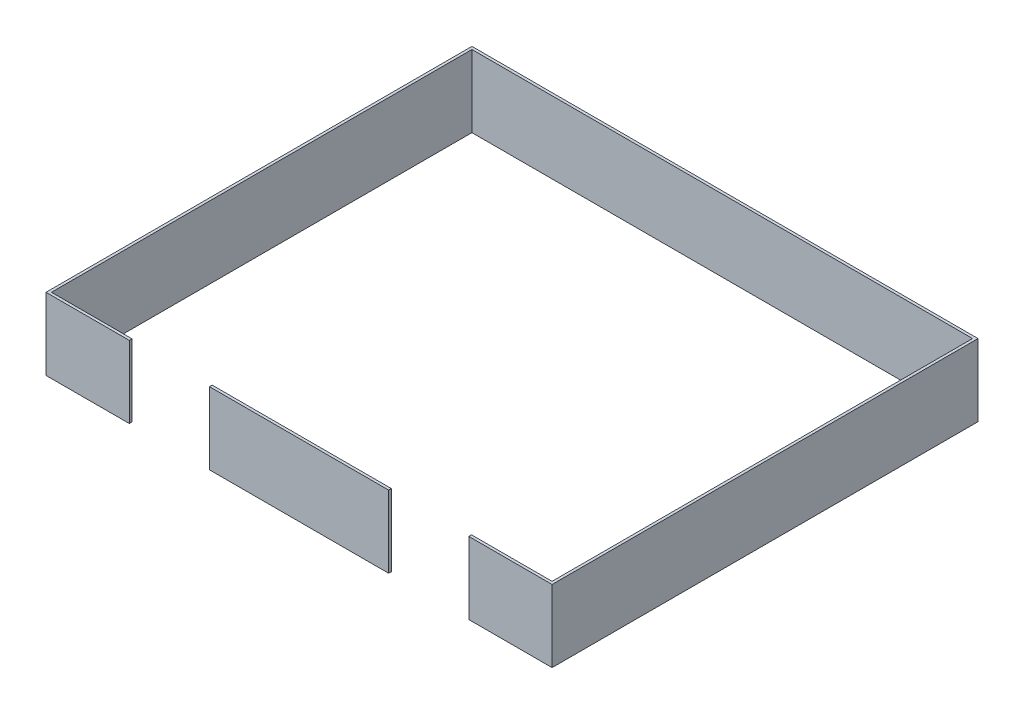
ISO-10303-21;
HEADER;
FILE_DESCRIPTION(('STEP AP214'),'2;1');
FILE_NAME('part.step','',(''),(''),'','','');
FILE_SCHEMA(('AUTOMOTIVE_DESIGN { 1 0 10303 214 1 1 1 1 }'));
ENDSEC;
DATA;
#1=APPLICATION_CONTEXT('core data for automotive mechanical design processes');
#2=APPLICATION_PROTOCOL_DEFINITION('international standard','automotive_design',2000,#1);
#3=PRODUCT_CONTEXT('',#1,'mechanical');
#4=PRODUCT('Part','Part','',(#3));
#5=PRODUCT_RELATED_PRODUCT_CATEGORY('part','',(#4));
#6=PRODUCT_DEFINITION_FORMATION('','',#4);
#7=PRODUCT_DEFINITION_CONTEXT('part definition',#1,'design');
#8=PRODUCT_DEFINITION('design','',#6,#7);
#9=PRODUCT_DEFINITION_SHAPE('','',#8);
#10=(LENGTH_UNIT() NAMED_UNIT(*) SI_UNIT(.MILLI.,.METRE.));
#11=(NAMED_UNIT(*) PLANE_ANGLE_UNIT() SI_UNIT($,.RADIAN.));
#12=(NAMED_UNIT(*) SI_UNIT($,.STERADIAN.) SOLID_ANGLE_UNIT());
#13=UNCERTAINTY_MEASURE_WITH_UNIT(LENGTH_MEASURE(1.E-05),#10,'distance_accuracy_value','');
#14=(GEOMETRIC_REPRESENTATION_CONTEXT(3) GLOBAL_UNCERTAINTY_ASSIGNED_CONTEXT((#13)) GLOBAL_UNIT_ASSIGNED_CONTEXT((#10,
#11,#12)) REPRESENTATION_CONTEXT('',''));
#15=CARTESIAN_POINT('',(0.,0.,0.));
#16=DIRECTION('',(0.,0.,1.));
#17=DIRECTION('',(1.,0.,0.));
#18=AXIS2_PLACEMENT_3D('',#15,#16,#17);
#19=CARTESIAN_POINT('',(3568.7,1016.,3003.54999999999));
#20=DIRECTION('',(0.,0.,1.));
#21=DIRECTION('',(1.,0.,0.));
#22=AXIS2_PLACEMENT_3D('',#19,#20,#21);
#23=PLANE('',#22);
#24=DIRECTION('',(0.,1.,0.));
#25=VECTOR('',#24,1.);
#26=CARTESIAN_POINT('',(2393.95,-1032.764,3003.54999999999));
#27=LINE('',#26,#25);
#28=CARTESIAN_POINT('',(2393.95,0.,3003.54999999999));
#29=VERTEX_POINT('',#28);
#30=CARTESIAN_POINT('',(2393.95,1016.,3003.54999999999));
#31=VERTEX_POINT('',#30);
#32=EDGE_CURVE('E212',#29,#31,#27,.T.);
#33=ORIENTED_EDGE('',*,*,#32,.F.);
#34=DIRECTION('',(-1.,0.,0.));
#35=VECTOR('',#34,1.);
#36=CARTESIAN_POINT('',(3568.7,0.,3003.54999999999));
#37=LINE('',#36,#35);
#38=CARTESIAN_POINT('',(3568.7,0.,3003.54999999999));
#39=VERTEX_POINT('',#38);
#40=EDGE_CURVE('E217',#39,#29,#37,.T.);
#41=ORIENTED_EDGE('',*,*,#40,.F.);
#42=DIRECTION('',(0.,-1.,0.));
#43=VECTOR('',#42,1.);
#44=CARTESIAN_POINT('',(3568.7,1016.,3003.54999999999));
#45=LINE('',#44,#43);
#46=CARTESIAN_POINT('',(3568.7,1016.,3003.54999999999));
#47=VERTEX_POINT('',#46);
#48=EDGE_CURVE('E240',#47,#39,#45,.T.);
#49=ORIENTED_EDGE('',*,*,#48,.F.);
#50=DIRECTION('',(-1.,0.,0.));
#51=VECTOR('',#50,1.);
#52=CARTESIAN_POINT('',(3568.7,1016.,3003.54999999999));
#53=LINE('',#52,#51);
#54=EDGE_CURVE('E183',#47,#31,#53,.T.);
#55=ORIENTED_EDGE('',*,*,#54,.T.);
#56=EDGE_LOOP('',(#33,#41,#49,#55));
#57=FACE_BOUND('',#56,.T.);
#58=ADVANCED_FACE('F71',(#57),#23,.T.);
#59=CARTESIAN_POINT('',(-3530.6,1016.,2965.44999999999));
#60=DIRECTION('',(0.,0.,-1.));
#61=DIRECTION('',(-1.,0.,0.));
#62=AXIS2_PLACEMENT_3D('',#59,#60,#61);
#63=PLANE('',#62);
#64=DIRECTION('',(0.,-1.,0.));
#65=VECTOR('',#64,1.);
#66=CARTESIAN_POINT('',(2393.95,1016.,2965.44999999999));
#67=LINE('',#66,#65);
#68=CARTESIAN_POINT('',(2393.95,1016.,2965.44999999999));
#69=VERTEX_POINT('',#68);
#70=CARTESIAN_POINT('',(2393.95,0.,2965.44999999999));
#71=VERTEX_POINT('',#70);
#72=EDGE_CURVE('E159',#69,#71,#67,.T.);
#73=ORIENTED_EDGE('',*,*,#72,.F.);
#74=DIRECTION('',(1.,0.,0.));
#75=VECTOR('',#74,1.);
#76=CARTESIAN_POINT('',(-3530.6,1016.,2965.44999999999));
#77=LINE('',#76,#75);
#78=CARTESIAN_POINT('',(3530.6,1016.,2965.44999999999));
#79=VERTEX_POINT('',#78);
#80=EDGE_CURVE('E174',#69,#79,#77,.T.);
#81=ORIENTED_EDGE('',*,*,#80,.T.);
#82=DIRECTION('',(0.,-1.,0.));
#83=VECTOR('',#82,1.);
#84=CARTESIAN_POINT('',(3530.6,1016.,2965.44999999999));
#85=LINE('',#84,#83);
#86=CARTESIAN_POINT('',(3530.6,0.,2965.44999999999));
#87=VERTEX_POINT('',#86);
#88=EDGE_CURVE('E182',#79,#87,#85,.T.);
#89=ORIENTED_EDGE('',*,*,#88,.T.);
#90=DIRECTION('',(1.,0.,0.));
#91=VECTOR('',#90,1.);
#92=CARTESIAN_POINT('',(-3530.6,0.,2965.44999999999));
#93=LINE('',#92,#91);
#94=EDGE_CURVE('E206',#71,#87,#93,.T.);
#95=ORIENTED_EDGE('',*,*,#94,.F.);
#96=EDGE_LOOP('',(#73,#81,#89,#95));
#97=FACE_BOUND('',#96,.T.);
#98=ADVANCED_FACE('F260',(#97),#63,.T.);
#99=CARTESIAN_POINT('',(0.,1016.,0.));
#100=DIRECTION('',(0.,1.,0.));
#101=DIRECTION('',(0.,0.,1.));
#102=AXIS2_PLACEMENT_3D('',#99,#100,#101);
#103=PLANE('',#102);
#104=DIRECTION('',(0.,0.,1.));
#105=VECTOR('',#104,1.);
#106=CARTESIAN_POINT('',(-2393.95,1016.,2965.44999999999));
#107=LINE('',#106,#105);
#108=CARTESIAN_POINT('',(-2393.95,1016.,2965.44999999999));
#109=VERTEX_POINT('',#108);
#110=CARTESIAN_POINT('',(-2393.95,1016.,3003.54999999999));
#111=VERTEX_POINT('',#110);
#112=EDGE_CURVE('E13',#109,#111,#107,.T.);
#113=ORIENTED_EDGE('',*,*,#112,.F.);
#114=CARTESIAN_POINT('',(-3530.6,1016.,2965.44999999999));
#115=VERTEX_POINT('',#114);
#116=EDGE_CURVE('E165',#115,#109,#77,.T.);
#117=ORIENTED_EDGE('',*,*,#116,.F.);
#118=DIRECTION('',(0.,0.,1.));
#119=VECTOR('',#118,1.);
#120=CARTESIAN_POINT('',(-3530.6,1016.,-2965.45));
#121=LINE('',#120,#119);
#122=CARTESIAN_POINT('',(-3530.6,1016.,-2965.45));
#123=VERTEX_POINT('',#122);
#124=EDGE_CURVE('E226',#123,#115,#121,.T.);
#125=ORIENTED_EDGE('',*,*,#124,.F.);
#126=DIRECTION('',(1.,0.,0.));
#127=VECTOR('',#126,1.);
#128=CARTESIAN_POINT('',(-3530.6,1016.,-2965.45));
#129=LINE('',#128,#127);
#130=CARTESIAN_POINT('',(3530.6,1016.,-2965.45));
#131=VERTEX_POINT('',#130);
#132=EDGE_CURVE('E189',#123,#131,#129,.T.);
#133=ORIENTED_EDGE('',*,*,#132,.T.);
#134=DIRECTION('',(0.,0.,1.));
#135=VECTOR('',#134,1.);
#136=CARTESIAN_POINT('',(3530.6,1016.,-2965.45));
#137=LINE('',#136,#135);
#138=EDGE_CURVE('E220',#131,#79,#137,.T.);
#139=ORIENTED_EDGE('',*,*,#138,.T.);
#140=ORIENTED_EDGE('',*,*,#80,.F.);
#141=DIRECTION('',(0.,0.,-1.));
#142=VECTOR('',#141,1.);
#143=CARTESIAN_POINT('',(2393.95,1016.,3003.54999999999));
#144=LINE('',#143,#142);
#145=EDGE_CURVE('E209',#31,#69,#144,.T.);
#146=ORIENTED_EDGE('',*,*,#145,.F.);
#147=ORIENTED_EDGE('',*,*,#54,.F.);
#148=DIRECTION('',(0.,0.,1.));
#149=VECTOR('',#148,1.);
#150=CARTESIAN_POINT('',(3568.7,1016.,-3003.55));
#151=LINE('',#150,#149);
#152=CARTESIAN_POINT('',(3568.7,1016.,-3003.55));
#153=VERTEX_POINT('',#152);
#154=EDGE_CURVE('E200',#153,#47,#151,.T.);
#155=ORIENTED_EDGE('',*,*,#154,.F.);
#156=DIRECTION('',(-1.,0.,0.));
#157=VECTOR('',#156,1.);
#158=CARTESIAN_POINT('',(3568.7,1016.,-3003.55));
#159=LINE('',#158,#157);
#160=CARTESIAN_POINT('',(-3568.7,1016.,-3003.55));
#161=VERTEX_POINT('',#160);
#162=EDGE_CURVE('E223',#153,#161,#159,.T.);
#163=ORIENTED_EDGE('',*,*,#162,.T.);
#164=DIRECTION('',(0.,0.,1.));
#165=VECTOR('',#164,1.);
#166=CARTESIAN_POINT('',(-3568.7,1016.,-3003.55));
#167=LINE('',#166,#165);
#168=CARTESIAN_POINT('',(-3568.7,1016.,3003.54999999999));
#169=VERTEX_POINT('',#168);
#170=EDGE_CURVE('E235',#161,#169,#167,.T.);
#171=ORIENTED_EDGE('',*,*,#170,.T.);
#172=EDGE_CURVE('E167',#111,#169,#53,.T.);
#173=ORIENTED_EDGE('',*,*,#172,.F.);
#174=EDGE_LOOP('',(#113,#117,#125,#133,#139,#140,#146,#147,#155,#163,#171,#173));
#175=FACE_BOUND('',#174,.T.);
#176=ADVANCED_FACE('F73',(#175),#103,.T.);
#177=CARTESIAN_POINT('',(0.,0.,0.));
#178=DIRECTION('',(0.,1.,0.));
#179=DIRECTION('',(0.,0.,1.));
#180=AXIS2_PLACEMENT_3D('',#177,#178,#179);
#181=PLANE('',#180);
#182=CARTESIAN_POINT('',(-3530.6,0.,2965.44999999999));
#183=VERTEX_POINT('',#182);
#184=CARTESIAN_POINT('',(-2393.95,0.,2965.44999999999));
#185=VERTEX_POINT('',#184);
#186=EDGE_CURVE('E75',#183,#185,#93,.T.);
#187=ORIENTED_EDGE('',*,*,#186,.T.);
#188=DIRECTION('',(0.,0.,1.));
#189=VECTOR('',#188,1.);
#190=CARTESIAN_POINT('',(-2393.95,0.,0.));
#191=LINE('',#190,#189);
#192=CARTESIAN_POINT('',(-2393.95,0.,3003.54999999999));
#193=VERTEX_POINT('',#192);
#194=EDGE_CURVE('E90',#185,#193,#191,.T.);
#195=ORIENTED_EDGE('',*,*,#194,.T.);
#196=CARTESIAN_POINT('',(-3568.7,0.,3003.54999999999));
#197=VERTEX_POINT('',#196);
#198=EDGE_CURVE('E219',#193,#197,#37,.T.);
#199=ORIENTED_EDGE('',*,*,#198,.T.);
#200=DIRECTION('',(0.,0.,1.));
#201=VECTOR('',#200,1.);
#202=CARTESIAN_POINT('',(-3568.7,0.,-3003.55));
#203=LINE('',#202,#201);
#204=CARTESIAN_POINT('',(-3568.7,0.,-3003.55));
#205=VERTEX_POINT('',#204);
#206=EDGE_CURVE('E179',#205,#197,#203,.T.);
#207=ORIENTED_EDGE('',*,*,#206,.F.);
#208=DIRECTION('',(-1.,0.,0.));
#209=VECTOR('',#208,1.);
#210=CARTESIAN_POINT('',(3568.7,0.,-3003.55));
#211=LINE('',#210,#209);
#212=CARTESIAN_POINT('',(3568.7,0.,-3003.55));
#213=VERTEX_POINT('',#212);
#214=EDGE_CURVE('E244',#213,#205,#211,.T.);
#215=ORIENTED_EDGE('',*,*,#214,.F.);
#216=DIRECTION('',(0.,0.,1.));
#217=VECTOR('',#216,1.);
#218=CARTESIAN_POINT('',(3568.7,0.,-3003.55));
#219=LINE('',#218,#217);
#220=EDGE_CURVE('E246',#213,#39,#219,.T.);
#221=ORIENTED_EDGE('',*,*,#220,.T.);
#222=ORIENTED_EDGE('',*,*,#40,.T.);
#223=DIRECTION('',(0.,0.,-1.));
#224=VECTOR('',#223,1.);
#225=CARTESIAN_POINT('',(2393.95000000003,0.,2.7903605352246E-11));
#226=LINE('',#225,#224);
#227=EDGE_CURVE('E214',#29,#71,#226,.T.);
#228=ORIENTED_EDGE('',*,*,#227,.T.);
#229=ORIENTED_EDGE('',*,*,#94,.T.);
#230=DIRECTION('',(0.,0.,1.));
#231=VECTOR('',#230,1.);
#232=CARTESIAN_POINT('',(3530.6,0.,-2965.45));
#233=LINE('',#232,#231);
#234=CARTESIAN_POINT('',(3530.6,0.,-2965.45));
#235=VERTEX_POINT('',#234);
#236=EDGE_CURVE('E172',#235,#87,#233,.T.);
#237=ORIENTED_EDGE('',*,*,#236,.F.);
#238=DIRECTION('',(1.,0.,0.));
#239=VECTOR('',#238,1.);
#240=CARTESIAN_POINT('',(-3530.6,0.,-2965.45));
#241=LINE('',#240,#239);
#242=CARTESIAN_POINT('',(-3530.6,0.,-2965.45));
#243=VERTEX_POINT('',#242);
#244=EDGE_CURVE('E229',#243,#235,#241,.T.);
#245=ORIENTED_EDGE('',*,*,#244,.F.);
#246=DIRECTION('',(0.,0.,1.));
#247=VECTOR('',#246,1.);
#248=CARTESIAN_POINT('',(-3530.6,0.,-2965.45));
#249=LINE('',#248,#247);
#250=EDGE_CURVE('E202',#243,#183,#249,.T.);
#251=ORIENTED_EDGE('',*,*,#250,.T.);
#252=EDGE_LOOP('',(#187,#195,#199,#207,#215,#221,#222,#228,#229,#237,#245,#251));
#253=FACE_BOUND('',#252,.T.);
#254=ADVANCED_FACE('F257',(#253),#181,.F.);
#255=DIRECTION('',(0.,1.,0.));
#256=VECTOR('',#255,1.);
#257=CARTESIAN_POINT('',(-2393.95,-1032.764,3003.54999999999));
#258=LINE('',#257,#256);
#259=EDGE_CURVE('E197',#193,#111,#258,.T.);
#260=ORIENTED_EDGE('',*,*,#259,.T.);
#261=ORIENTED_EDGE('',*,*,#172,.T.);
#262=DIRECTION('',(0.,-1.,0.));
#263=VECTOR('',#262,1.);
#264=CARTESIAN_POINT('',(-3568.7,1016.,3003.54999999999));
#265=LINE('',#264,#263);
#266=EDGE_CURVE('E196',#169,#197,#265,.T.);
#267=ORIENTED_EDGE('',*,*,#266,.T.);
#268=ORIENTED_EDGE('',*,*,#198,.F.);
#269=EDGE_LOOP('',(#260,#261,#267,#268));
#270=FACE_BOUND('',#269,.T.);
#271=ADVANCED_FACE('F283',(#270),#23,.T.);
#272=CARTESIAN_POINT('',(3568.7,1016.,-3003.55));
#273=DIRECTION('',(1.,0.,0.));
#274=DIRECTION('',(0.,0.,-1.));
#275=AXIS2_PLACEMENT_3D('',#272,#273,#274);
#276=PLANE('',#275);
#277=ORIENTED_EDGE('',*,*,#220,.F.);
#278=DIRECTION('',(0.,-1.,0.));
#279=VECTOR('',#278,1.);
#280=CARTESIAN_POINT('',(3568.7,1016.,-3003.55));
#281=LINE('',#280,#279);
#282=EDGE_CURVE('E243',#153,#213,#281,.T.);
#283=ORIENTED_EDGE('',*,*,#282,.F.);
#284=ORIENTED_EDGE('',*,*,#154,.T.);
#285=ORIENTED_EDGE('',*,*,#48,.T.);
#286=EDGE_LOOP('',(#277,#283,#284,#285));
#287=FACE_BOUND('',#286,.T.);
#288=ADVANCED_FACE('F288',(#287),#276,.T.);
#289=CARTESIAN_POINT('',(3568.7,1016.,-3003.55));
#290=DIRECTION('',(0.,0.,1.));
#291=DIRECTION('',(1.,0.,0.));
#292=AXIS2_PLACEMENT_3D('',#289,#290,#291);
#293=PLANE('',#292);
#294=ORIENTED_EDGE('',*,*,#214,.T.);
#295=DIRECTION('',(0.,-1.,0.));
#296=VECTOR('',#295,1.);
#297=CARTESIAN_POINT('',(-3568.7,1016.,-3003.55));
#298=LINE('',#297,#296);
#299=EDGE_CURVE('E173',#161,#205,#298,.T.);
#300=ORIENTED_EDGE('',*,*,#299,.F.);
#301=ORIENTED_EDGE('',*,*,#162,.F.);
#302=ORIENTED_EDGE('',*,*,#282,.T.);
#303=EDGE_LOOP('',(#294,#300,#301,#302));
#304=FACE_BOUND('',#303,.T.);
#305=ADVANCED_FACE('F293',(#304),#293,.F.);
#306=CARTESIAN_POINT('',(-3568.7,1016.,-3003.55));
#307=DIRECTION('',(1.,0.,0.));
#308=DIRECTION('',(0.,0.,-1.));
#309=AXIS2_PLACEMENT_3D('',#306,#307,#308);
#310=PLANE('',#309);
#311=ORIENTED_EDGE('',*,*,#206,.T.);
#312=ORIENTED_EDGE('',*,*,#266,.F.);
#313=ORIENTED_EDGE('',*,*,#170,.F.);
#314=ORIENTED_EDGE('',*,*,#299,.T.);
#315=EDGE_LOOP('',(#311,#312,#313,#314));
#316=FACE_BOUND('',#315,.T.);
#317=ADVANCED_FACE('F278',(#316),#310,.F.);
#318=DIRECTION('',(0.,1.,0.));
#319=VECTOR('',#318,1.);
#320=CARTESIAN_POINT('',(-2393.95,1016.,2965.44999999999));
#321=LINE('',#320,#319);
#322=EDGE_CURVE('E81',#185,#109,#321,.T.);
#323=ORIENTED_EDGE('',*,*,#322,.F.);
#324=ORIENTED_EDGE('',*,*,#186,.F.);
#325=DIRECTION('',(0.,-1.,0.));
#326=VECTOR('',#325,1.);
#327=CARTESIAN_POINT('',(-3530.6,1016.,2965.44999999999));
#328=LINE('',#327,#326);
#329=EDGE_CURVE('E171',#115,#183,#328,.T.);
#330=ORIENTED_EDGE('',*,*,#329,.F.);
#331=ORIENTED_EDGE('',*,*,#116,.T.);
#332=EDGE_LOOP('',(#323,#324,#330,#331));
#333=FACE_BOUND('',#332,.T.);
#334=ADVANCED_FACE('F169',(#333),#63,.T.);
#335=CARTESIAN_POINT('',(3530.6,1016.,-2965.45));
#336=DIRECTION('',(1.,0.,0.));
#337=DIRECTION('',(0.,0.,-1.));
#338=AXIS2_PLACEMENT_3D('',#335,#336,#337);
#339=PLANE('',#338);
#340=ORIENTED_EDGE('',*,*,#236,.T.);
#341=ORIENTED_EDGE('',*,*,#88,.F.);
#342=ORIENTED_EDGE('',*,*,#138,.F.);
#343=DIRECTION('',(0.,-1.,0.));
#344=VECTOR('',#343,1.);
#345=CARTESIAN_POINT('',(3530.6,1016.,-2965.45));
#346=LINE('',#345,#344);
#347=EDGE_CURVE('E176',#131,#235,#346,.T.);
#348=ORIENTED_EDGE('',*,*,#347,.T.);
#349=EDGE_LOOP('',(#340,#341,#342,#348));
#350=FACE_BOUND('',#349,.T.);
#351=ADVANCED_FACE('F270',(#350),#339,.F.);
#352=CARTESIAN_POINT('',(-3530.6,1016.,-2965.45));
#353=DIRECTION('',(0.,0.,-1.));
#354=DIRECTION('',(-1.,0.,0.));
#355=AXIS2_PLACEMENT_3D('',#352,#353,#354);
#356=PLANE('',#355);
#357=ORIENTED_EDGE('',*,*,#244,.T.);
#358=ORIENTED_EDGE('',*,*,#347,.F.);
#359=ORIENTED_EDGE('',*,*,#132,.F.);
#360=DIRECTION('',(0.,-1.,0.));
#361=VECTOR('',#360,1.);
#362=CARTESIAN_POINT('',(-3530.6,1016.,-2965.45));
#363=LINE('',#362,#361);
#364=EDGE_CURVE('E227',#123,#243,#363,.T.);
#365=ORIENTED_EDGE('',*,*,#364,.T.);
#366=EDGE_LOOP('',(#357,#358,#359,#365));
#367=FACE_BOUND('',#366,.T.);
#368=ADVANCED_FACE('F268',(#367),#356,.F.);
#369=CARTESIAN_POINT('',(-3530.6,1016.,-2965.45));
#370=DIRECTION('',(1.,0.,0.));
#371=DIRECTION('',(0.,0.,-1.));
#372=AXIS2_PLACEMENT_3D('',#369,#370,#371);
#373=PLANE('',#372);
#374=ORIENTED_EDGE('',*,*,#250,.F.);
#375=ORIENTED_EDGE('',*,*,#364,.F.);
#376=ORIENTED_EDGE('',*,*,#124,.T.);
#377=ORIENTED_EDGE('',*,*,#329,.T.);
#378=EDGE_LOOP('',(#374,#375,#376,#377));
#379=FACE_BOUND('',#378,.T.);
#380=ADVANCED_FACE('F264',(#379),#373,.T.);
#381=CARTESIAN_POINT('',(2393.95,-1032.764,3003.54999999999));
#382=DIRECTION('',(1.,0.,0.));
#383=DIRECTION('',(0.,0.,-1.));
#384=AXIS2_PLACEMENT_3D('',#381,#382,#383);
#385=PLANE('',#384);
#386=ORIENTED_EDGE('',*,*,#32,.T.);
#387=ORIENTED_EDGE('',*,*,#145,.T.);
#388=ORIENTED_EDGE('',*,*,#72,.T.);
#389=ORIENTED_EDGE('',*,*,#227,.F.);
#390=EDGE_LOOP('',(#386,#387,#388,#389));
#391=FACE_BOUND('',#390,.T.);
#392=ADVANCED_FACE('F252',(#391),#385,.F.);
#393=CARTESIAN_POINT('',(-2393.95,-1032.764,2965.44999999999));
#394=DIRECTION('',(-1.,0.,0.));
#395=DIRECTION('',(0.,0.,1.));
#396=AXIS2_PLACEMENT_3D('',#393,#394,#395);
#397=PLANE('',#396);
#398=ORIENTED_EDGE('',*,*,#322,.T.);
#399=ORIENTED_EDGE('',*,*,#112,.T.);
#400=ORIENTED_EDGE('',*,*,#259,.F.);
#401=ORIENTED_EDGE('',*,*,#194,.F.);
#402=EDGE_LOOP('',(#398,#399,#400,#401));
#403=FACE_BOUND('',#402,.T.);
#404=ADVANCED_FACE('F155',(#403),#397,.F.);
#405=CLOSED_SHELL('',(#58,#98,#176,#254,#271,#288,#305,#317,#334,#351,#368,#380,#392,#404));
#406=MANIFOLD_SOLID_BREP('B2',#405);
#407=CARTESIAN_POINT('',(-3530.6,1016.,2965.44999999999));
#408=DIRECTION('',(0.,0.,-1.));
#409=DIRECTION('',(-1.,0.,0.));
#410=AXIS2_PLACEMENT_3D('',#407,#408,#409);
#411=PLANE('',#410);
#412=DIRECTION('',(0.,-1.,0.));
#413=VECTOR('',#412,1.);
#414=CARTESIAN_POINT('',(-1263.65,1016.,2965.44999999999));
#415=LINE('',#414,#413);
#416=CARTESIAN_POINT('',(-1263.65,1016.,2965.44999999999));
#417=VERTEX_POINT('',#416);
#418=CARTESIAN_POINT('',(-1263.65,0.,2965.44999999999));
#419=VERTEX_POINT('',#418);
#420=EDGE_CURVE('E69',#417,#419,#415,.T.);
#421=ORIENTED_EDGE('',*,*,#420,.F.);
#422=DIRECTION('',(1.,0.,0.));
#423=VECTOR('',#422,1.);
#424=CARTESIAN_POINT('',(-3530.6,1016.,2965.44999999999));
#425=LINE('',#424,#423);
#426=CARTESIAN_POINT('',(1263.65,1016.,2965.44999999999));
#427=VERTEX_POINT('',#426);
#428=EDGE_CURVE('E451',#417,#427,#425,.T.);
#429=ORIENTED_EDGE('',*,*,#428,.T.);
#430=DIRECTION('',(0.,1.,0.));
#431=VECTOR('',#430,1.);
#432=CARTESIAN_POINT('',(1263.65,1016.,2965.44999999999));
#433=LINE('',#432,#431);
#434=CARTESIAN_POINT('',(1263.65,0.,2965.44999999999));
#435=VERTEX_POINT('',#434);
#436=EDGE_CURVE('E405',#435,#427,#433,.T.);
#437=ORIENTED_EDGE('',*,*,#436,.F.);
#438=DIRECTION('',(1.,0.,0.));
#439=VECTOR('',#438,1.);
#440=CARTESIAN_POINT('',(-3530.6,0.,2965.44999999999));
#441=LINE('',#440,#439);
#442=EDGE_CURVE('E459',#419,#435,#441,.T.);
#443=ORIENTED_EDGE('',*,*,#442,.F.);
#444=EDGE_LOOP('',(#421,#429,#437,#443));
#445=FACE_BOUND('',#444,.T.);
#446=ADVANCED_FACE('F397',(#445),#411,.T.);
#447=CARTESIAN_POINT('',(3568.7,1016.,3003.54999999999));
#448=DIRECTION('',(0.,0.,1.));
#449=DIRECTION('',(1.,0.,0.));
#450=AXIS2_PLACEMENT_3D('',#447,#448,#449);
#451=PLANE('',#450);
#452=DIRECTION('',(0.,1.,0.));
#453=VECTOR('',#452,1.);
#454=CARTESIAN_POINT('',(-1263.65,-1032.764,3003.54999999999));
#455=LINE('',#454,#453);
#456=CARTESIAN_POINT('',(-1263.65,0.,3003.54999999999));
#457=VERTEX_POINT('',#456);
#458=CARTESIAN_POINT('',(-1263.65,1016.,3003.54999999999));
#459=VERTEX_POINT('',#458);
#460=EDGE_CURVE('E435',#457,#459,#455,.T.);
#461=ORIENTED_EDGE('',*,*,#460,.F.);
#462=DIRECTION('',(-1.,0.,0.));
#463=VECTOR('',#462,1.);
#464=CARTESIAN_POINT('',(3568.7,0.,3003.54999999999));
#465=LINE('',#464,#463);
#466=CARTESIAN_POINT('',(1263.65,0.,3003.54999999999));
#467=VERTEX_POINT('',#466);
#468=EDGE_CURVE('E455',#467,#457,#465,.T.);
#469=ORIENTED_EDGE('',*,*,#468,.F.);
#470=DIRECTION('',(0.,1.,0.));
#471=VECTOR('',#470,1.);
#472=CARTESIAN_POINT('',(1263.65,-1032.764,3003.54999999999));
#473=LINE('',#472,#471);
#474=CARTESIAN_POINT('',(1263.65,1016.,3003.54999999999));
#475=VERTEX_POINT('',#474);
#476=EDGE_CURVE('E452',#467,#475,#473,.T.);
#477=ORIENTED_EDGE('',*,*,#476,.T.);
#478=DIRECTION('',(-1.,0.,0.));
#479=VECTOR('',#478,1.);
#480=CARTESIAN_POINT('',(3568.7,1016.,3003.54999999999));
#481=LINE('',#480,#479);
#482=EDGE_CURVE('E449',#475,#459,#481,.T.);
#483=ORIENTED_EDGE('',*,*,#482,.T.);
#484=EDGE_LOOP('',(#461,#469,#477,#483));
#485=FACE_BOUND('',#484,.T.);
#486=ADVANCED_FACE('F399',(#485),#451,.T.);
#487=CARTESIAN_POINT('',(0.,0.,0.));
#488=DIRECTION('',(0.,1.,0.));
#489=DIRECTION('',(0.,0.,1.));
#490=AXIS2_PLACEMENT_3D('',#487,#488,#489);
#491=PLANE('',#490);
#492=ORIENTED_EDGE('',*,*,#468,.T.);
#493=DIRECTION('',(0.,0.,-1.));
#494=VECTOR('',#493,1.);
#495=CARTESIAN_POINT('',(-1263.65,0.,0.));
#496=LINE('',#495,#494);
#497=EDGE_CURVE('E438',#457,#419,#496,.T.);
#498=ORIENTED_EDGE('',*,*,#497,.T.);
#499=ORIENTED_EDGE('',*,*,#442,.T.);
#500=DIRECTION('',(0.,0.,1.));
#501=VECTOR('',#500,1.);
#502=CARTESIAN_POINT('',(1263.65,0.,0.));
#503=LINE('',#502,#501);
#504=EDGE_CURVE('E419',#435,#467,#503,.T.);
#505=ORIENTED_EDGE('',*,*,#504,.T.);
#506=EDGE_LOOP('',(#492,#498,#499,#505));
#507=FACE_BOUND('',#506,.T.);
#508=ADVANCED_FACE('F471',(#507),#491,.F.);
#509=CARTESIAN_POINT('',(0.,1016.,0.));
#510=DIRECTION('',(0.,1.,0.));
#511=DIRECTION('',(0.,0.,1.));
#512=AXIS2_PLACEMENT_3D('',#509,#510,#511);
#513=PLANE('',#512);
#514=DIRECTION('',(0.,0.,-1.));
#515=VECTOR('',#514,1.);
#516=CARTESIAN_POINT('',(-1263.65,1016.,3003.54999999999));
#517=LINE('',#516,#515);
#518=EDGE_CURVE('E411',#459,#417,#517,.T.);
#519=ORIENTED_EDGE('',*,*,#518,.F.);
#520=ORIENTED_EDGE('',*,*,#482,.F.);
#521=DIRECTION('',(0.,0.,1.));
#522=VECTOR('',#521,1.);
#523=CARTESIAN_POINT('',(1263.65,1016.,2965.44999999999));
#524=LINE('',#523,#522);
#525=EDGE_CURVE('E466',#427,#475,#524,.T.);
#526=ORIENTED_EDGE('',*,*,#525,.F.);
#527=ORIENTED_EDGE('',*,*,#428,.F.);
#528=EDGE_LOOP('',(#519,#520,#526,#527));
#529=FACE_BOUND('',#528,.T.);
#530=ADVANCED_FACE('F447',(#529),#513,.T.);
#531=CARTESIAN_POINT('',(1263.65,-1032.764,2965.44999999999));
#532=DIRECTION('',(-1.,0.,0.));
#533=DIRECTION('',(0.,0.,1.));
#534=AXIS2_PLACEMENT_3D('',#531,#532,#533);
#535=PLANE('',#534);
#536=ORIENTED_EDGE('',*,*,#436,.T.);
#537=ORIENTED_EDGE('',*,*,#525,.T.);
#538=ORIENTED_EDGE('',*,*,#476,.F.);
#539=ORIENTED_EDGE('',*,*,#504,.F.);
#540=EDGE_LOOP('',(#536,#537,#538,#539));
#541=FACE_BOUND('',#540,.T.);
#542=ADVANCED_FACE('F467',(#541),#535,.F.);
#543=CARTESIAN_POINT('',(-1263.65,-1032.764,3003.54999999999));
#544=DIRECTION('',(1.,0.,0.));
#545=DIRECTION('',(0.,0.,-1.));
#546=AXIS2_PLACEMENT_3D('',#543,#544,#545);
#547=PLANE('',#546);
#548=ORIENTED_EDGE('',*,*,#460,.T.);
#549=ORIENTED_EDGE('',*,*,#518,.T.);
#550=ORIENTED_EDGE('',*,*,#420,.T.);
#551=ORIENTED_EDGE('',*,*,#497,.F.);
#552=EDGE_LOOP('',(#548,#549,#550,#551));
#553=FACE_BOUND('',#552,.T.);
#554=ADVANCED_FACE('F436',(#553),#547,.F.);
#555=CLOSED_SHELL('',(#446,#486,#508,#530,#542,#554));
#556=MANIFOLD_SOLID_BREP('B7',#555);
#557=ADVANCED_BREP_SHAPE_REPRESENTATION('',(#18,#406,#556),#14);
#558=SHAPE_DEFINITION_REPRESENTATION(#9,#557);
ENDSEC;
END-ISO-10303-21;
